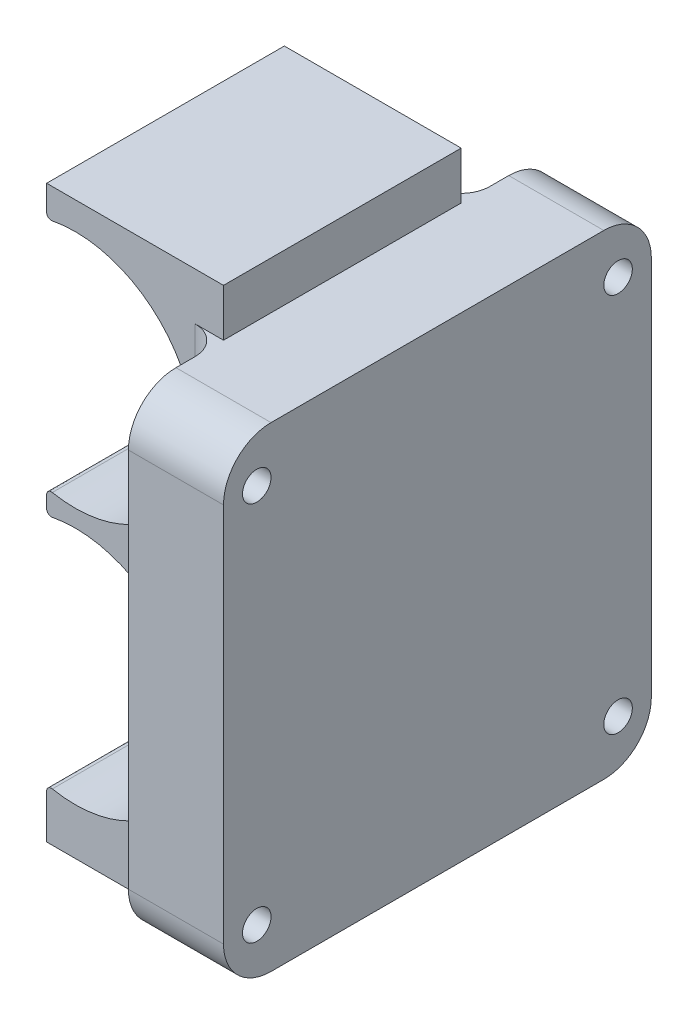
ISO-10303-21;
HEADER;
FILE_DESCRIPTION(('STEP AP214'),'2;1');
FILE_NAME('part.step','',(''),(''),'','','');
FILE_SCHEMA(('AUTOMOTIVE_DESIGN { 1 0 10303 214 1 1 1 1 }'));
ENDSEC;
DATA;
#1=APPLICATION_CONTEXT('core data for automotive mechanical design processes');
#2=APPLICATION_PROTOCOL_DEFINITION('international standard','automotive_design',2000,#1);
#3=PRODUCT_CONTEXT('',#1,'mechanical');
#4=PRODUCT('Part','Part','',(#3));
#5=PRODUCT_RELATED_PRODUCT_CATEGORY('part','',(#4));
#6=PRODUCT_DEFINITION_FORMATION('','',#4);
#7=PRODUCT_DEFINITION_CONTEXT('part definition',#1,'design');
#8=PRODUCT_DEFINITION('design','',#6,#7);
#9=PRODUCT_DEFINITION_SHAPE('','',#8);
#10=(LENGTH_UNIT() NAMED_UNIT(*) SI_UNIT(.MILLI.,.METRE.));
#11=(NAMED_UNIT(*) PLANE_ANGLE_UNIT() SI_UNIT($,.RADIAN.));
#12=(NAMED_UNIT(*) SI_UNIT($,.STERADIAN.) SOLID_ANGLE_UNIT());
#13=UNCERTAINTY_MEASURE_WITH_UNIT(LENGTH_MEASURE(1.E-05),#10,'distance_accuracy_value','');
#14=(GEOMETRIC_REPRESENTATION_CONTEXT(3) GLOBAL_UNCERTAINTY_ASSIGNED_CONTEXT((#13)) GLOBAL_UNIT_ASSIGNED_CONTEXT((#10,
#11,#12)) REPRESENTATION_CONTEXT('',''));
#15=CARTESIAN_POINT('',(0.,0.,0.));
#16=DIRECTION('',(0.,0.,1.));
#17=DIRECTION('',(1.,0.,0.));
#18=AXIS2_PLACEMENT_3D('',#15,#16,#17);
#19=CARTESIAN_POINT('',(0.,0.,25.));
#20=DIRECTION('',(0.,0.,1.));
#21=DIRECTION('',(1.,0.,0.));
#22=AXIS2_PLACEMENT_3D('',#19,#20,#21);
#23=PLANE('',#22);
#24=DIRECTION('',(0.,1.,0.));
#25=VECTOR('',#24,1.);
#26=CARTESIAN_POINT('',(-3.,0.,25.));
#27=LINE('',#26,#25);
#28=CARTESIAN_POINT('',(-3.,42.5,25.));
#29=VERTEX_POINT('',#28);
#30=CARTESIAN_POINT('',(-3.,53.,25.));
#31=VERTEX_POINT('',#30);
#32=EDGE_CURVE('E322',#29,#31,#27,.T.);
#33=ORIENTED_EDGE('',*,*,#32,.T.);
#34=DIRECTION('',(1.,0.,0.));
#35=VECTOR('',#34,1.);
#36=CARTESIAN_POINT('',(10.,53.,25.));
#37=LINE('',#36,#35);
#38=CARTESIAN_POINT('',(0.,53.,25.));
#39=VERTEX_POINT('',#38);
#40=EDGE_CURVE('E325',#31,#39,#37,.T.);
#41=ORIENTED_EDGE('',*,*,#40,.T.);
#42=DIRECTION('',(0.,1.,0.));
#43=VECTOR('',#42,1.);
#44=CARTESIAN_POINT('',(0.,0.,25.));
#45=LINE('',#44,#43);
#46=CARTESIAN_POINT('',(0.,58.,25.));
#47=VERTEX_POINT('',#46);
#48=EDGE_CURVE('E413',#39,#47,#45,.T.);
#49=ORIENTED_EDGE('',*,*,#48,.T.);
#50=DIRECTION('',(-1.,0.,0.));
#51=VECTOR('',#50,1.);
#52=CARTESIAN_POINT('',(0.,58.,25.));
#53=LINE('',#52,#51);
#54=CARTESIAN_POINT('',(-18.6,58.,25.));
#55=VERTEX_POINT('',#54);
#56=EDGE_CURVE('E264',#47,#55,#53,.T.);
#57=ORIENTED_EDGE('',*,*,#56,.T.);
#58=DIRECTION('',(0.,-1.,0.));
#59=VECTOR('',#58,1.);
#60=CARTESIAN_POINT('',(-18.6,0.,25.));
#61=LINE('',#60,#59);
#62=CARTESIAN_POINT('',(-18.6,55.3592379245428,25.));
#63=VERTEX_POINT('',#62);
#64=EDGE_CURVE('E253',#55,#63,#61,.T.);
#65=ORIENTED_EDGE('',*,*,#64,.T.);
#66=CARTESIAN_POINT('',(-18.1,55.3592379245428,25.));
#67=DIRECTION('',(0.,0.,1.));
#68=DIRECTION('',(1.,0.,0.));
#69=AXIS2_PLACEMENT_3D('',#66,#67,#68);
#70=CIRCLE('',#69,0.5);
#71=CARTESIAN_POINT('',(-18.0045801526717,54.8684273167358,25.));
#72=VERTEX_POINT('',#71);
#73=EDGE_CURVE('E289',#63,#72,#70,.T.);
#74=ORIENTED_EDGE('',*,*,#73,.T.);
#75=CARTESIAN_POINT('',(-15.6,42.5,25.));
#76=DIRECTION('',(0.,0.,1.));
#77=DIRECTION('',(1.,0.,0.));
#78=AXIS2_PLACEMENT_3D('',#75,#76,#77);
#79=CIRCLE('',#78,12.6);
#80=EDGE_CURVE('E404',#72,#29,#79,.F.);
#81=ORIENTED_EDGE('',*,*,#80,.T.);
#82=EDGE_LOOP('',(#33,#41,#49,#57,#65,#74,#81));
#83=FACE_BOUND('',#82,.T.);
#84=ADVANCED_FACE('F35',(#83),#23,.T.);
#85=CARTESIAN_POINT('',(-15.6,15.5,25.));
#86=DIRECTION('',(0.,0.,1.));
#87=DIRECTION('',(1.,0.,0.));
#88=AXIS2_PLACEMENT_3D('',#85,#86,#87);
#89=CIRCLE('',#88,12.6);
#90=CARTESIAN_POINT('',(-3.,15.5,25.));
#91=VERTEX_POINT('',#90);
#92=CARTESIAN_POINT('',(-18.0045801526717,27.8684273167358,25.));
#93=VERTEX_POINT('',#92);
#94=EDGE_CURVE('E410',#91,#93,#89,.T.);
#95=ORIENTED_EDGE('',*,*,#94,.F.);
#96=DIRECTION('',(0.,1.,0.));
#97=VECTOR('',#96,1.);
#98=CARTESIAN_POINT('',(-3.,0.,25.));
#99=LINE('',#98,#97);
#100=EDGE_CURVE('E320',#91,#29,#99,.T.);
#101=ORIENTED_EDGE('',*,*,#100,.T.);
#102=CARTESIAN_POINT('',(-18.0045801526717,30.1315726832642,25.));
#103=VERTEX_POINT('',#102);
#104=EDGE_CURVE('E401',#29,#103,#79,.F.);
#105=ORIENTED_EDGE('',*,*,#104,.T.);
#106=CARTESIAN_POINT('',(-18.1,29.6407620754572,25.));
#107=DIRECTION('',(0.,0.,1.));
#108=DIRECTION('',(1.,0.,0.));
#109=AXIS2_PLACEMENT_3D('',#106,#107,#108);
#110=CIRCLE('',#109,0.5);
#111=CARTESIAN_POINT('',(-18.6,29.6407620754572,25.));
#112=VERTEX_POINT('',#111);
#113=EDGE_CURVE('E284',#103,#112,#110,.T.);
#114=ORIENTED_EDGE('',*,*,#113,.T.);
#115=CARTESIAN_POINT('',(-18.6,28.3592379245428,25.));
#116=VERTEX_POINT('',#115);
#117=EDGE_CURVE('E402',#112,#116,#61,.T.);
#118=ORIENTED_EDGE('',*,*,#117,.T.);
#119=CARTESIAN_POINT('',(-18.1,28.3592379245428,25.));
#120=DIRECTION('',(0.,0.,1.));
#121=DIRECTION('',(1.,0.,0.));
#122=AXIS2_PLACEMENT_3D('',#119,#120,#121);
#123=CIRCLE('',#122,0.5);
#124=EDGE_CURVE('E286',#116,#93,#123,.T.);
#125=ORIENTED_EDGE('',*,*,#124,.T.);
#126=EDGE_LOOP('',(#95,#101,#105,#114,#118,#125));
#127=FACE_BOUND('',#126,.T.);
#128=ADVANCED_FACE('F441',(#127),#23,.T.);
#129=CARTESIAN_POINT('',(0.,0.,0.));
#130=DIRECTION('',(0.,0.,1.));
#131=DIRECTION('',(1.,0.,0.));
#132=AXIS2_PLACEMENT_3D('',#129,#130,#131);
#133=PLANE('',#132);
#134=DIRECTION('',(0.,1.,0.));
#135=VECTOR('',#134,1.);
#136=CARTESIAN_POINT('',(0.,0.,0.));
#137=LINE('',#136,#135);
#138=CARTESIAN_POINT('',(0.,53.,0.));
#139=VERTEX_POINT('',#138);
#140=CARTESIAN_POINT('',(0.,58.,0.));
#141=VERTEX_POINT('',#140);
#142=EDGE_CURVE('E251',#139,#141,#137,.T.);
#143=ORIENTED_EDGE('',*,*,#142,.F.);
#144=DIRECTION('',(-1.,0.,0.));
#145=VECTOR('',#144,1.);
#146=CARTESIAN_POINT('',(0.,53.,0.));
#147=LINE('',#146,#145);
#148=CARTESIAN_POINT('',(-3.,53.,0.));
#149=VERTEX_POINT('',#148);
#150=EDGE_CURVE('E313',#139,#149,#147,.T.);
#151=ORIENTED_EDGE('',*,*,#150,.T.);
#152=DIRECTION('',(0.,1.,0.));
#153=VECTOR('',#152,1.);
#154=CARTESIAN_POINT('',(-3.,3.,0.));
#155=LINE('',#154,#153);
#156=CARTESIAN_POINT('',(-3.,42.5,0.));
#157=VERTEX_POINT('',#156);
#158=EDGE_CURVE('E311',#149,#157,#155,.F.);
#159=ORIENTED_EDGE('',*,*,#158,.T.);
#160=CARTESIAN_POINT('',(-15.6,42.5,0.));
#161=DIRECTION('',(0.,0.,1.));
#162=DIRECTION('',(1.,0.,0.));
#163=AXIS2_PLACEMENT_3D('',#160,#161,#162);
#164=CIRCLE('',#163,12.6);
#165=CARTESIAN_POINT('',(-18.0045801526717,54.8684273167358,0.));
#166=VERTEX_POINT('',#165);
#167=EDGE_CURVE('E418',#166,#157,#164,.F.);
#168=ORIENTED_EDGE('',*,*,#167,.F.);
#169=CARTESIAN_POINT('',(-18.1,55.3592379245428,0.));
#170=DIRECTION('',(0.,0.,1.));
#171=DIRECTION('',(1.,0.,0.));
#172=AXIS2_PLACEMENT_3D('',#169,#170,#171);
#173=CIRCLE('',#172,0.5);
#174=CARTESIAN_POINT('',(-18.6,55.3592379245428,0.));
#175=VERTEX_POINT('',#174);
#176=EDGE_CURVE('E275',#166,#175,#173,.F.);
#177=ORIENTED_EDGE('',*,*,#176,.T.);
#178=DIRECTION('',(0.,-1.,0.));
#179=VECTOR('',#178,1.);
#180=CARTESIAN_POINT('',(-18.6,0.,0.));
#181=LINE('',#180,#179);
#182=CARTESIAN_POINT('',(-18.6,58.,0.));
#183=VERTEX_POINT('',#182);
#184=EDGE_CURVE('E398',#183,#175,#181,.T.);
#185=ORIENTED_EDGE('',*,*,#184,.F.);
#186=DIRECTION('',(-1.,0.,0.));
#187=VECTOR('',#186,1.);
#188=CARTESIAN_POINT('',(0.,58.,0.));
#189=LINE('',#188,#187);
#190=EDGE_CURVE('E250',#141,#183,#189,.T.);
#191=ORIENTED_EDGE('',*,*,#190,.F.);
#192=EDGE_LOOP('',(#143,#151,#159,#168,#177,#185,#191));
#193=FACE_BOUND('',#192,.T.);
#194=ADVANCED_FACE('F472',(#193),#133,.F.);
#195=CARTESIAN_POINT('',(-18.0045801526717,30.1315726832642,0.));
#196=VERTEX_POINT('',#195);
#197=EDGE_CURVE('E416',#157,#196,#164,.F.);
#198=ORIENTED_EDGE('',*,*,#197,.F.);
#199=DIRECTION('',(0.,1.,0.));
#200=VECTOR('',#199,1.);
#201=CARTESIAN_POINT('',(-3.,3.,0.));
#202=LINE('',#201,#200);
#203=CARTESIAN_POINT('',(-3.,15.5,0.));
#204=VERTEX_POINT('',#203);
#205=EDGE_CURVE('E309',#157,#204,#202,.F.);
#206=ORIENTED_EDGE('',*,*,#205,.T.);
#207=CARTESIAN_POINT('',(-15.6,15.5,0.));
#208=DIRECTION('',(0.,0.,1.));
#209=DIRECTION('',(1.,0.,0.));
#210=AXIS2_PLACEMENT_3D('',#207,#208,#209);
#211=CIRCLE('',#210,12.6);
#212=CARTESIAN_POINT('',(-18.0045801526717,27.8684273167358,0.));
#213=VERTEX_POINT('',#212);
#214=EDGE_CURVE('E424',#204,#213,#211,.T.);
#215=ORIENTED_EDGE('',*,*,#214,.T.);
#216=CARTESIAN_POINT('',(-18.1,28.3592379245428,0.));
#217=DIRECTION('',(0.,0.,1.));
#218=DIRECTION('',(1.,0.,0.));
#219=AXIS2_PLACEMENT_3D('',#216,#217,#218);
#220=CIRCLE('',#219,0.5);
#221=CARTESIAN_POINT('',(-18.6,28.3592379245428,0.));
#222=VERTEX_POINT('',#221);
#223=EDGE_CURVE('E273',#213,#222,#220,.F.);
#224=ORIENTED_EDGE('',*,*,#223,.T.);
#225=CARTESIAN_POINT('',(-18.6,29.6407620754572,0.));
#226=VERTEX_POINT('',#225);
#227=EDGE_CURVE('E417',#226,#222,#181,.T.);
#228=ORIENTED_EDGE('',*,*,#227,.F.);
#229=CARTESIAN_POINT('',(-18.1,29.6407620754572,0.));
#230=DIRECTION('',(0.,0.,1.));
#231=DIRECTION('',(1.,0.,0.));
#232=AXIS2_PLACEMENT_3D('',#229,#230,#231);
#233=CIRCLE('',#232,0.5);
#234=EDGE_CURVE('E270',#226,#196,#233,.F.);
#235=ORIENTED_EDGE('',*,*,#234,.T.);
#236=EDGE_LOOP('',(#198,#206,#215,#224,#228,#235));
#237=FACE_BOUND('',#236,.T.);
#238=ADVANCED_FACE('F433',(#237),#133,.F.);
#239=CARTESIAN_POINT('',(0.,0.,25.));
#240=DIRECTION('',(-1.,0.,0.));
#241=DIRECTION('',(0.,0.,1.));
#242=AXIS2_PLACEMENT_3D('',#239,#240,#241);
#243=PLANE('',#242);
#244=DIRECTION('',(0.,0.,-1.));
#245=VECTOR('',#244,1.);
#246=CARTESIAN_POINT('',(0.,3.,0.));
#247=LINE('',#246,#245);
#248=CARTESIAN_POINT('',(0.,3.,25.));
#249=VERTEX_POINT('',#248);
#250=CARTESIAN_POINT('',(0.,3.,0.));
#251=VERTEX_POINT('',#250);
#252=EDGE_CURVE('E235',#249,#251,#247,.T.);
#253=ORIENTED_EDGE('',*,*,#252,.F.);
#254=CARTESIAN_POINT('',(0.,-2.,25.));
#255=VERTEX_POINT('',#254);
#256=EDGE_CURVE('E411',#255,#249,#45,.T.);
#257=ORIENTED_EDGE('',*,*,#256,.F.);
#258=DIRECTION('',(0.,0.,1.));
#259=VECTOR('',#258,1.);
#260=CARTESIAN_POINT('',(0.,-2.,0.));
#261=LINE('',#260,#259);
#262=CARTESIAN_POINT('',(0.,-2.,0.));
#263=VERTEX_POINT('',#262);
#264=EDGE_CURVE('E249',#263,#255,#261,.T.);
#265=ORIENTED_EDGE('',*,*,#264,.F.);
#266=EDGE_CURVE('E226',#263,#251,#137,.T.);
#267=ORIENTED_EDGE('',*,*,#266,.T.);
#268=EDGE_LOOP('',(#253,#257,#265,#267));
#269=FACE_BOUND('',#268,.T.);
#270=ADVANCED_FACE('F247',(#269),#243,.F.);
#271=CARTESIAN_POINT('',(-18.6,0.,25.));
#272=DIRECTION('',(1.,0.,0.));
#273=DIRECTION('',(0.,0.,-1.));
#274=AXIS2_PLACEMENT_3D('',#271,#272,#273);
#275=PLANE('',#274);
#276=ORIENTED_EDGE('',*,*,#184,.T.);
#277=DIRECTION('',(0.,0.,-1.));
#278=VECTOR('',#277,1.);
#279=CARTESIAN_POINT('',(-18.6,55.3592379245428,25.));
#280=LINE('',#279,#278);
#281=EDGE_CURVE('E299',#175,#63,#280,.F.);
#282=ORIENTED_EDGE('',*,*,#281,.T.);
#283=ORIENTED_EDGE('',*,*,#64,.F.);
#284=DIRECTION('',(0.,0.,-1.));
#285=VECTOR('',#284,1.);
#286=CARTESIAN_POINT('',(-18.6,58.,25.));
#287=LINE('',#286,#285);
#288=EDGE_CURVE('E260',#55,#183,#287,.T.);
#289=ORIENTED_EDGE('',*,*,#288,.T.);
#290=EDGE_LOOP('',(#276,#282,#283,#289));
#291=FACE_BOUND('',#290,.T.);
#292=ADVANCED_FACE('F465',(#291),#275,.F.);
#293=CARTESIAN_POINT('',(-15.6,42.5,25.));
#294=DIRECTION('',(0.,0.,-1.));
#295=DIRECTION('',(-1.,0.,0.));
#296=AXIS2_PLACEMENT_3D('',#293,#294,#295);
#297=CYLINDRICAL_SURFACE('',#296,12.6);
#298=ORIENTED_EDGE('',*,*,#80,.F.);
#299=DIRECTION('',(0.,0.,-1.));
#300=VECTOR('',#299,1.);
#301=CARTESIAN_POINT('',(-18.0045801526717,54.8684273167358,25.));
#302=LINE('',#301,#300);
#303=EDGE_CURVE('E296',#72,#166,#302,.T.);
#304=ORIENTED_EDGE('',*,*,#303,.T.);
#305=ORIENTED_EDGE('',*,*,#167,.T.);
#306=ORIENTED_EDGE('',*,*,#197,.T.);
#307=DIRECTION('',(0.,0.,-1.));
#308=VECTOR('',#307,1.);
#309=CARTESIAN_POINT('',(-18.0045801526717,30.1315726832642,25.));
#310=LINE('',#309,#308);
#311=EDGE_CURVE('E293',#196,#103,#310,.F.);
#312=ORIENTED_EDGE('',*,*,#311,.T.);
#313=ORIENTED_EDGE('',*,*,#104,.F.);
#314=EDGE_LOOP('',(#298,#304,#305,#306,#312,#313));
#315=FACE_BOUND('',#314,.T.);
#316=ADVANCED_FACE('F427',(#315),#297,.F.);
#317=ORIENTED_EDGE('',*,*,#227,.T.);
#318=DIRECTION('',(0.,0.,1.));
#319=VECTOR('',#318,1.);
#320=CARTESIAN_POINT('',(-18.6,28.3592379245428,25.));
#321=LINE('',#320,#319);
#322=EDGE_CURVE('E304',#222,#116,#321,.T.);
#323=ORIENTED_EDGE('',*,*,#322,.T.);
#324=ORIENTED_EDGE('',*,*,#117,.F.);
#325=DIRECTION('',(0.,0.,-1.));
#326=VECTOR('',#325,1.);
#327=CARTESIAN_POINT('',(-18.6,29.6407620754572,25.));
#328=LINE('',#327,#326);
#329=EDGE_CURVE('E301',#112,#226,#328,.T.);
#330=ORIENTED_EDGE('',*,*,#329,.T.);
#331=EDGE_LOOP('',(#317,#323,#324,#330));
#332=FACE_BOUND('',#331,.T.);
#333=ADVANCED_FACE('F444',(#332),#275,.F.);
#334=CARTESIAN_POINT('',(-15.6,15.5,25.));
#335=DIRECTION('',(0.,0.,-1.));
#336=DIRECTION('',(-1.,0.,0.));
#337=AXIS2_PLACEMENT_3D('',#334,#335,#336);
#338=CYLINDRICAL_SURFACE('',#337,12.6);
#339=CARTESIAN_POINT('',(-18.0045801526717,3.13157268326417,0.));
#340=VERTEX_POINT('',#339);
#341=EDGE_CURVE('E257',#340,#204,#211,.T.);
#342=ORIENTED_EDGE('',*,*,#341,.F.);
#343=DIRECTION('',(0.,0.,-1.));
#344=VECTOR('',#343,1.);
#345=CARTESIAN_POINT('',(-18.0045801526717,3.13157268326417,25.));
#346=LINE('',#345,#344);
#347=CARTESIAN_POINT('',(-18.0045801526717,3.13157268326417,25.));
#348=VERTEX_POINT('',#347);
#349=EDGE_CURVE('E282',#340,#348,#346,.F.);
#350=ORIENTED_EDGE('',*,*,#349,.T.);
#351=EDGE_CURVE('E407',#348,#91,#89,.T.);
#352=ORIENTED_EDGE('',*,*,#351,.T.);
#353=ORIENTED_EDGE('',*,*,#94,.T.);
#354=DIRECTION('',(0.,0.,-1.));
#355=VECTOR('',#354,1.);
#356=CARTESIAN_POINT('',(-18.0045801526717,27.8684273167358,25.));
#357=LINE('',#356,#355);
#358=EDGE_CURVE('E279',#93,#213,#357,.T.);
#359=ORIENTED_EDGE('',*,*,#358,.T.);
#360=ORIENTED_EDGE('',*,*,#214,.F.);
#361=EDGE_LOOP('',(#342,#350,#352,#353,#359,#360));
#362=FACE_BOUND('',#361,.T.);
#363=ADVANCED_FACE('F481',(#362),#338,.F.);
#364=CARTESIAN_POINT('',(-18.6,2.64076207545719,25.));
#365=VERTEX_POINT('',#364);
#366=CARTESIAN_POINT('',(-18.6,-2.,25.));
#367=VERTEX_POINT('',#366);
#368=EDGE_CURVE('E403',#365,#367,#61,.T.);
#369=ORIENTED_EDGE('',*,*,#368,.F.);
#370=DIRECTION('',(0.,0.,1.));
#371=VECTOR('',#370,1.);
#372=CARTESIAN_POINT('',(-18.6,2.64076207545719,0.));
#373=LINE('',#372,#371);
#374=CARTESIAN_POINT('',(-18.6,2.64076207545719,0.));
#375=VERTEX_POINT('',#374);
#376=EDGE_CURVE('E267',#365,#375,#373,.F.);
#377=ORIENTED_EDGE('',*,*,#376,.T.);
#378=CARTESIAN_POINT('',(-18.6,-2.,0.));
#379=VERTEX_POINT('',#378);
#380=EDGE_CURVE('E255',#375,#379,#181,.T.);
#381=ORIENTED_EDGE('',*,*,#380,.T.);
#382=DIRECTION('',(0.,0.,-1.));
#383=VECTOR('',#382,1.);
#384=CARTESIAN_POINT('',(-18.6,-2.,25.));
#385=LINE('',#384,#383);
#386=EDGE_CURVE('E388',#367,#379,#385,.T.);
#387=ORIENTED_EDGE('',*,*,#386,.F.);
#388=EDGE_LOOP('',(#369,#377,#381,#387));
#389=FACE_BOUND('',#388,.T.);
#390=ADVANCED_FACE('F487',(#389),#275,.F.);
#391=ORIENTED_EDGE('',*,*,#48,.F.);
#392=DIRECTION('',(0.,0.,-1.));
#393=VECTOR('',#392,1.);
#394=CARTESIAN_POINT('',(0.,53.,0.));
#395=LINE('',#394,#393);
#396=EDGE_CURVE('E242',#39,#139,#395,.T.);
#397=ORIENTED_EDGE('',*,*,#396,.T.);
#398=ORIENTED_EDGE('',*,*,#142,.T.);
#399=DIRECTION('',(0.,0.,-1.));
#400=VECTOR('',#399,1.);
#401=CARTESIAN_POINT('',(0.,58.,25.));
#402=LINE('',#401,#400);
#403=EDGE_CURVE('E263',#47,#141,#402,.T.);
#404=ORIENTED_EDGE('',*,*,#403,.F.);
#405=EDGE_LOOP('',(#391,#397,#398,#404));
#406=FACE_BOUND('',#405,.T.);
#407=ADVANCED_FACE('F457',(#406),#243,.F.);
#408=CARTESIAN_POINT('',(0.,58.,25.));
#409=DIRECTION('',(0.,-1.,0.));
#410=DIRECTION('',(0.,0.,-1.));
#411=AXIS2_PLACEMENT_3D('',#408,#409,#410);
#412=PLANE('',#411);
#413=ORIENTED_EDGE('',*,*,#190,.T.);
#414=ORIENTED_EDGE('',*,*,#288,.F.);
#415=ORIENTED_EDGE('',*,*,#56,.F.);
#416=ORIENTED_EDGE('',*,*,#403,.T.);
#417=EDGE_LOOP('',(#413,#414,#415,#416));
#418=FACE_BOUND('',#417,.T.);
#419=ADVANCED_FACE('F461',(#418),#412,.F.);
#420=DIRECTION('',(-1.,0.,0.));
#421=VECTOR('',#420,1.);
#422=CARTESIAN_POINT('',(0.,3.,25.));
#423=LINE('',#422,#421);
#424=CARTESIAN_POINT('',(-3.,3.,25.));
#425=VERTEX_POINT('',#424);
#426=EDGE_CURVE('E239',#249,#425,#423,.T.);
#427=ORIENTED_EDGE('',*,*,#426,.T.);
#428=DIRECTION('',(0.,1.,0.));
#429=VECTOR('',#428,1.);
#430=CARTESIAN_POINT('',(-3.,0.,25.));
#431=LINE('',#430,#429);
#432=EDGE_CURVE('E317',#425,#91,#431,.T.);
#433=ORIENTED_EDGE('',*,*,#432,.T.);
#434=ORIENTED_EDGE('',*,*,#351,.F.);
#435=CARTESIAN_POINT('',(-18.1,2.64076207545719,25.));
#436=DIRECTION('',(0.,0.,1.));
#437=DIRECTION('',(1.,0.,0.));
#438=AXIS2_PLACEMENT_3D('',#435,#436,#437);
#439=CIRCLE('',#438,0.5);
#440=EDGE_CURVE('E291',#348,#365,#439,.T.);
#441=ORIENTED_EDGE('',*,*,#440,.T.);
#442=ORIENTED_EDGE('',*,*,#368,.T.);
#443=DIRECTION('',(-1.,0.,0.));
#444=VECTOR('',#443,1.);
#445=CARTESIAN_POINT('',(0.,-2.,25.));
#446=LINE('',#445,#444);
#447=EDGE_CURVE('E395',#255,#367,#446,.T.);
#448=ORIENTED_EDGE('',*,*,#447,.F.);
#449=ORIENTED_EDGE('',*,*,#256,.T.);
#450=EDGE_LOOP('',(#427,#433,#434,#441,#442,#448,#449));
#451=FACE_BOUND('',#450,.T.);
#452=ADVANCED_FACE('F491',(#451),#23,.T.);
#453=ORIENTED_EDGE('',*,*,#341,.T.);
#454=DIRECTION('',(0.,1.,0.));
#455=VECTOR('',#454,1.);
#456=CARTESIAN_POINT('',(-3.,3.,0.));
#457=LINE('',#456,#455);
#458=CARTESIAN_POINT('',(-3.,3.,0.));
#459=VERTEX_POINT('',#458);
#460=EDGE_CURVE('E229',#204,#459,#457,.F.);
#461=ORIENTED_EDGE('',*,*,#460,.T.);
#462=DIRECTION('',(1.,0.,0.));
#463=VECTOR('',#462,1.);
#464=CARTESIAN_POINT('',(10.,3.,0.));
#465=LINE('',#464,#463);
#466=EDGE_CURVE('E220',#459,#251,#465,.T.);
#467=ORIENTED_EDGE('',*,*,#466,.T.);
#468=ORIENTED_EDGE('',*,*,#266,.F.);
#469=DIRECTION('',(1.,0.,0.));
#470=VECTOR('',#469,1.);
#471=CARTESIAN_POINT('',(-18.6,-2.,0.));
#472=LINE('',#471,#470);
#473=EDGE_CURVE('E391',#379,#263,#472,.T.);
#474=ORIENTED_EDGE('',*,*,#473,.F.);
#475=ORIENTED_EDGE('',*,*,#380,.F.);
#476=CARTESIAN_POINT('',(-18.1,2.64076207545719,0.));
#477=DIRECTION('',(0.,0.,1.));
#478=DIRECTION('',(1.,0.,0.));
#479=AXIS2_PLACEMENT_3D('',#476,#477,#478);
#480=CIRCLE('',#479,0.5);
#481=EDGE_CURVE('E277',#375,#340,#480,.F.);
#482=ORIENTED_EDGE('',*,*,#481,.T.);
#483=EDGE_LOOP('',(#453,#461,#467,#468,#474,#475,#482));
#484=FACE_BOUND('',#483,.T.);
#485=ADVANCED_FACE('F223',(#484),#133,.F.);
#486=CARTESIAN_POINT('',(0.,-2.,0.));
#487=DIRECTION('',(0.,-1.,0.));
#488=DIRECTION('',(1.,0.,0.));
#489=AXIS2_PLACEMENT_3D('',#486,#487,#488);
#490=PLANE('',#489);
#491=ORIENTED_EDGE('',*,*,#386,.T.);
#492=ORIENTED_EDGE('',*,*,#473,.T.);
#493=ORIENTED_EDGE('',*,*,#264,.T.);
#494=ORIENTED_EDGE('',*,*,#447,.T.);
#495=EDGE_LOOP('',(#491,#492,#493,#494));
#496=FACE_BOUND('',#495,.T.);
#497=ADVANCED_FACE('F490',(#496),#490,.T.);
#498=CARTESIAN_POINT('',(-18.1,2.64076207545719,25.));
#499=DIRECTION('',(0.,0.,-1.));
#500=DIRECTION('',(-1.,0.,0.));
#501=AXIS2_PLACEMENT_3D('',#498,#499,#500);
#502=CYLINDRICAL_SURFACE('',#501,0.5);
#503=ORIENTED_EDGE('',*,*,#440,.F.);
#504=ORIENTED_EDGE('',*,*,#349,.F.);
#505=ORIENTED_EDGE('',*,*,#481,.F.);
#506=ORIENTED_EDGE('',*,*,#376,.F.);
#507=EDGE_LOOP('',(#503,#504,#505,#506));
#508=FACE_BOUND('',#507,.T.);
#509=ADVANCED_FACE('F571',(#508),#502,.T.);
#510=CARTESIAN_POINT('',(-18.1,55.3592379245428,25.));
#511=DIRECTION('',(0.,0.,-1.));
#512=DIRECTION('',(-1.,0.,0.));
#513=AXIS2_PLACEMENT_3D('',#510,#511,#512);
#514=CYLINDRICAL_SURFACE('',#513,0.5);
#515=ORIENTED_EDGE('',*,*,#73,.F.);
#516=ORIENTED_EDGE('',*,*,#281,.F.);
#517=ORIENTED_EDGE('',*,*,#176,.F.);
#518=ORIENTED_EDGE('',*,*,#303,.F.);
#519=EDGE_LOOP('',(#515,#516,#517,#518));
#520=FACE_BOUND('',#519,.T.);
#521=ADVANCED_FACE('F470',(#520),#514,.T.);
#522=CARTESIAN_POINT('',(-18.1,28.3592379245428,25.));
#523=DIRECTION('',(0.,0.,-1.));
#524=DIRECTION('',(-1.,0.,0.));
#525=AXIS2_PLACEMENT_3D('',#522,#523,#524);
#526=CYLINDRICAL_SURFACE('',#525,0.5);
#527=ORIENTED_EDGE('',*,*,#124,.F.);
#528=ORIENTED_EDGE('',*,*,#322,.F.);
#529=ORIENTED_EDGE('',*,*,#223,.F.);
#530=ORIENTED_EDGE('',*,*,#358,.F.);
#531=EDGE_LOOP('',(#527,#528,#529,#530));
#532=FACE_BOUND('',#531,.T.);
#533=ADVANCED_FACE('F577',(#532),#526,.T.);
#534=CARTESIAN_POINT('',(-18.1,29.6407620754572,25.));
#535=DIRECTION('',(0.,0.,-1.));
#536=DIRECTION('',(-1.,0.,0.));
#537=AXIS2_PLACEMENT_3D('',#534,#535,#536);
#538=CYLINDRICAL_SURFACE('',#537,0.5);
#539=ORIENTED_EDGE('',*,*,#113,.F.);
#540=ORIENTED_EDGE('',*,*,#311,.F.);
#541=ORIENTED_EDGE('',*,*,#234,.F.);
#542=ORIENTED_EDGE('',*,*,#329,.F.);
#543=EDGE_LOOP('',(#539,#540,#541,#542));
#544=FACE_BOUND('',#543,.T.);
#545=ADVANCED_FACE('F436',(#544),#538,.T.);
#546=CARTESIAN_POINT('',(0.,0.,0.));
#547=DIRECTION('',(1.,0.,0.));
#548=DIRECTION('',(0.,0.,-1.));
#549=AXIS2_PLACEMENT_3D('',#546,#547,#548);
#550=PLANE('',#549);
#551=CARTESIAN_POINT('',(0.,8.,-6.5));
#552=DIRECTION('',(-1.,0.,0.));
#553=DIRECTION('',(0.,0.,1.));
#554=AXIS2_PLACEMENT_3D('',#551,#552,#553);
#555=CIRCLE('',#554,1.5);
#556=CARTESIAN_POINT('',(0.,8.,-5.));
#557=VERTEX_POINT('',#556);
#558=EDGE_CURVE('E886',#557,#557,#555,.T.);
#559=ORIENTED_EDGE('',*,*,#558,.F.);
#560=EDGE_LOOP('',(#559));
#561=FACE_BOUND('',#560,.T.);
#562=CARTESIAN_POINT('',(0.,48.,-6.5));
#563=DIRECTION('',(-1.,0.,0.));
#564=DIRECTION('',(0.,0.,1.));
#565=AXIS2_PLACEMENT_3D('',#562,#563,#564);
#566=CIRCLE('',#565,1.5);
#567=CARTESIAN_POINT('',(0.,48.,-5.));
#568=VERTEX_POINT('',#567);
#569=EDGE_CURVE('E520',#568,#568,#566,.T.);
#570=ORIENTED_EDGE('',*,*,#569,.F.);
#571=EDGE_LOOP('',(#570));
#572=FACE_BOUND('',#571,.T.);
#573=CARTESIAN_POINT('',(0.,53.,-3.));
#574=VERTEX_POINT('',#573);
#575=CARTESIAN_POINT('',(0.,53.,-5.00000000000001));
#576=VERTEX_POINT('',#575);
#577=EDGE_CURVE('E378',#574,#576,#395,.T.);
#578=ORIENTED_EDGE('',*,*,#577,.T.);
#579=CARTESIAN_POINT('',(0.,48.,-5.));
#580=DIRECTION('',(1.,0.,0.));
#581=DIRECTION('',(0.,0.,-1.));
#582=AXIS2_PLACEMENT_3D('',#579,#580,#581);
#583=CIRCLE('',#582,5.);
#584=CARTESIAN_POINT('',(0.,48.,-10.));
#585=VERTEX_POINT('',#584);
#586=EDGE_CURVE('E58',#576,#585,#583,.F.);
#587=ORIENTED_EDGE('',*,*,#586,.T.);
#588=DIRECTION('',(0.,-1.,0.));
#589=VECTOR('',#588,1.);
#590=CARTESIAN_POINT('',(0.,0.,-9.99999999999999));
#591=LINE('',#590,#589);
#592=CARTESIAN_POINT('',(0.,8.,-10.));
#593=VERTEX_POINT('',#592);
#594=EDGE_CURVE('E370',#585,#593,#591,.T.);
#595=ORIENTED_EDGE('',*,*,#594,.T.);
#596=CARTESIAN_POINT('',(0.,8.,-5.));
#597=DIRECTION('',(1.,0.,0.));
#598=DIRECTION('',(0.,0.,-1.));
#599=AXIS2_PLACEMENT_3D('',#596,#597,#598);
#600=CIRCLE('',#599,5.);
#601=CARTESIAN_POINT('',(0.,3.,-4.99999999999999));
#602=VERTEX_POINT('',#601);
#603=EDGE_CURVE('E50',#593,#602,#600,.F.);
#604=ORIENTED_EDGE('',*,*,#603,.T.);
#605=CARTESIAN_POINT('',(0.,3.,-3.));
#606=VERTEX_POINT('',#605);
#607=EDGE_CURVE('E245',#606,#602,#247,.T.);
#608=ORIENTED_EDGE('',*,*,#607,.F.);
#609=DIRECTION('',(0.,1.,0.));
#610=VECTOR('',#609,1.);
#611=CARTESIAN_POINT('',(0.,53.,-3.));
#612=LINE('',#611,#610);
#613=EDGE_CURVE('E232',#606,#574,#612,.T.);
#614=ORIENTED_EDGE('',*,*,#613,.T.);
#615=EDGE_LOOP('',(#578,#587,#595,#604,#608,#614));
#616=FACE_BOUND('',#615,.T.);
#617=ADVANCED_FACE('F375',(#561,#572,#616),#550,.F.);
#618=CARTESIAN_POINT('',(10.,3.,0.));
#619=DIRECTION('',(0.,1.,0.));
#620=DIRECTION('',(0.,0.,1.));
#621=AXIS2_PLACEMENT_3D('',#618,#619,#620);
#622=PLANE('',#621);
#623=DIRECTION('',(0.,0.,-1.));
#624=VECTOR('',#623,1.);
#625=CARTESIAN_POINT('',(10.,3.,0.));
#626=LINE('',#625,#624);
#627=CARTESIAN_POINT('',(10.,3.,30.));
#628=VERTEX_POINT('',#627);
#629=CARTESIAN_POINT('',(10.,3.,-4.99999999999999));
#630=VERTEX_POINT('',#629);
#631=EDGE_CURVE('E387',#628,#630,#626,.T.);
#632=ORIENTED_EDGE('',*,*,#631,.F.);
#633=DIRECTION('',(-1.,0.,0.));
#634=VECTOR('',#633,1.);
#635=CARTESIAN_POINT('',(10.,3.,30.));
#636=LINE('',#635,#634);
#637=CARTESIAN_POINT('',(0.,3.,30.));
#638=VERTEX_POINT('',#637);
#639=EDGE_CURVE('E341',#628,#638,#636,.T.);
#640=ORIENTED_EDGE('',*,*,#639,.T.);
#641=CARTESIAN_POINT('',(0.,3.,28.));
#642=VERTEX_POINT('',#641);
#643=EDGE_CURVE('E244',#638,#642,#247,.T.);
#644=ORIENTED_EDGE('',*,*,#643,.T.);
#645=CARTESIAN_POINT('',(-3.,3.,28.));
#646=DIRECTION('',(0.,1.,0.));
#647=DIRECTION('',(0.,0.,1.));
#648=AXIS2_PLACEMENT_3D('',#645,#646,#647);
#649=CIRCLE('',#648,3.);
#650=EDGE_CURVE('E337',#642,#425,#649,.T.);
#651=ORIENTED_EDGE('',*,*,#650,.T.);
#652=ORIENTED_EDGE('',*,*,#426,.F.);
#653=ORIENTED_EDGE('',*,*,#252,.T.);
#654=ORIENTED_EDGE('',*,*,#466,.F.);
#655=CARTESIAN_POINT('',(-3.,3.,-3.));
#656=DIRECTION('',(0.,1.,0.));
#657=DIRECTION('',(0.,0.,1.));
#658=AXIS2_PLACEMENT_3D('',#655,#656,#657);
#659=CIRCLE('',#658,3.);
#660=EDGE_CURVE('E332',#459,#606,#659,.T.);
#661=ORIENTED_EDGE('',*,*,#660,.T.);
#662=ORIENTED_EDGE('',*,*,#607,.T.);
#663=DIRECTION('',(-1.,0.,0.));
#664=VECTOR('',#663,1.);
#665=CARTESIAN_POINT('',(10.,3.,-4.99999999999999));
#666=LINE('',#665,#664);
#667=EDGE_CURVE('E339',#602,#630,#666,.F.);
#668=ORIENTED_EDGE('',*,*,#667,.T.);
#669=EDGE_LOOP('',(#632,#640,#644,#651,#652,#653,#654,#661,#662,#668));
#670=FACE_BOUND('',#669,.T.);
#671=ADVANCED_FACE('F237',(#670),#622,.F.);
#672=CARTESIAN_POINT('',(10.,0.,-9.99999999999999));
#673=DIRECTION('',(0.,0.,-1.));
#674=DIRECTION('',(0.,1.,0.));
#675=AXIS2_PLACEMENT_3D('',#672,#673,#674);
#676=PLANE('',#675);
#677=ORIENTED_EDGE('',*,*,#594,.F.);
#678=DIRECTION('',(-1.,0.,0.));
#679=VECTOR('',#678,1.);
#680=CARTESIAN_POINT('',(10.,48.,-10.));
#681=LINE('',#680,#679);
#682=CARTESIAN_POINT('',(10.,48.,-10.));
#683=VERTEX_POINT('',#682);
#684=EDGE_CURVE('E11',#585,#683,#681,.F.);
#685=ORIENTED_EDGE('',*,*,#684,.T.);
#686=DIRECTION('',(0.,-1.,0.));
#687=VECTOR('',#686,1.);
#688=CARTESIAN_POINT('',(10.,0.,-9.99999999999999));
#689=LINE('',#688,#687);
#690=CARTESIAN_POINT('',(10.,8.,-10.));
#691=VERTEX_POINT('',#690);
#692=EDGE_CURVE('E373',#683,#691,#689,.T.);
#693=ORIENTED_EDGE('',*,*,#692,.T.);
#694=DIRECTION('',(-1.,0.,0.));
#695=VECTOR('',#694,1.);
#696=CARTESIAN_POINT('',(0.,8.,-9.99999999999999));
#697=LINE('',#696,#695);
#698=EDGE_CURVE('E43',#691,#593,#697,.T.);
#699=ORIENTED_EDGE('',*,*,#698,.T.);
#700=EDGE_LOOP('',(#677,#685,#693,#699));
#701=FACE_BOUND('',#700,.T.);
#702=ADVANCED_FACE('F369',(#701),#676,.T.);
#703=CARTESIAN_POINT('',(10.,53.,0.));
#704=DIRECTION('',(0.,1.,0.));
#705=DIRECTION('',(0.,0.,1.));
#706=AXIS2_PLACEMENT_3D('',#703,#704,#705);
#707=PLANE('',#706);
#708=DIRECTION('',(0.,0.,-1.));
#709=VECTOR('',#708,1.);
#710=CARTESIAN_POINT('',(10.,53.,0.));
#711=LINE('',#710,#709);
#712=CARTESIAN_POINT('',(10.,53.,30.));
#713=VERTEX_POINT('',#712);
#714=CARTESIAN_POINT('',(10.,53.,-5.00000000000001));
#715=VERTEX_POINT('',#714);
#716=EDGE_CURVE('E517',#713,#715,#711,.T.);
#717=ORIENTED_EDGE('',*,*,#716,.T.);
#718=DIRECTION('',(-1.,0.,0.));
#719=VECTOR('',#718,1.);
#720=CARTESIAN_POINT('',(10.,53.,-5.00000000000001));
#721=LINE('',#720,#719);
#722=EDGE_CURVE('E363',#715,#576,#721,.T.);
#723=ORIENTED_EDGE('',*,*,#722,.T.);
#724=ORIENTED_EDGE('',*,*,#577,.F.);
#725=CARTESIAN_POINT('',(-3.,53.,-3.));
#726=DIRECTION('',(0.,1.,0.));
#727=DIRECTION('',(0.,0.,1.));
#728=AXIS2_PLACEMENT_3D('',#725,#726,#727);
#729=CIRCLE('',#728,3.);
#730=EDGE_CURVE('E330',#574,#149,#729,.F.);
#731=ORIENTED_EDGE('',*,*,#730,.T.);
#732=ORIENTED_EDGE('',*,*,#150,.F.);
#733=ORIENTED_EDGE('',*,*,#396,.F.);
#734=ORIENTED_EDGE('',*,*,#40,.F.);
#735=CARTESIAN_POINT('',(-3.,53.,28.));
#736=DIRECTION('',(0.,1.,0.));
#737=DIRECTION('',(0.,0.,1.));
#738=AXIS2_PLACEMENT_3D('',#735,#736,#737);
#739=CIRCLE('',#738,3.);
#740=CARTESIAN_POINT('',(0.,53.,28.));
#741=VERTEX_POINT('',#740);
#742=EDGE_CURVE('E334',#31,#741,#739,.F.);
#743=ORIENTED_EDGE('',*,*,#742,.T.);
#744=CARTESIAN_POINT('',(0.,53.,30.));
#745=VERTEX_POINT('',#744);
#746=EDGE_CURVE('E380',#745,#741,#395,.T.);
#747=ORIENTED_EDGE('',*,*,#746,.F.);
#748=DIRECTION('',(-1.,0.,0.));
#749=VECTOR('',#748,1.);
#750=CARTESIAN_POINT('',(10.,53.,30.));
#751=LINE('',#750,#749);
#752=EDGE_CURVE('E361',#745,#713,#751,.F.);
#753=ORIENTED_EDGE('',*,*,#752,.T.);
#754=EDGE_LOOP('',(#717,#723,#724,#731,#732,#733,#734,#743,#747,#753));
#755=FACE_BOUND('',#754,.T.);
#756=ADVANCED_FACE('F503',(#755),#707,.T.);
#757=CARTESIAN_POINT('',(10.,0.,35.));
#758=DIRECTION('',(0.,0.,-1.));
#759=DIRECTION('',(0.,1.,0.));
#760=AXIS2_PLACEMENT_3D('',#757,#758,#759);
#761=PLANE('',#760);
#762=DIRECTION('',(0.,-1.,0.));
#763=VECTOR('',#762,1.);
#764=CARTESIAN_POINT('',(0.,0.,35.));
#765=LINE('',#764,#763);
#766=CARTESIAN_POINT('',(0.,48.,35.));
#767=VERTEX_POINT('',#766);
#768=CARTESIAN_POINT('',(0.,8.,35.));
#769=VERTEX_POINT('',#768);
#770=EDGE_CURVE('E384',#767,#769,#765,.T.);
#771=ORIENTED_EDGE('',*,*,#770,.T.);
#772=DIRECTION('',(-1.,0.,0.));
#773=VECTOR('',#772,1.);
#774=CARTESIAN_POINT('',(10.,8.,35.));
#775=LINE('',#774,#773);
#776=CARTESIAN_POINT('',(10.,8.,35.));
#777=VERTEX_POINT('',#776);
#778=EDGE_CURVE('E351',#769,#777,#775,.F.);
#779=ORIENTED_EDGE('',*,*,#778,.T.);
#780=DIRECTION('',(0.,-1.,0.));
#781=VECTOR('',#780,1.);
#782=CARTESIAN_POINT('',(10.,0.,35.));
#783=LINE('',#782,#781);
#784=CARTESIAN_POINT('',(10.,48.,35.));
#785=VERTEX_POINT('',#784);
#786=EDGE_CURVE('E392',#785,#777,#783,.T.);
#787=ORIENTED_EDGE('',*,*,#786,.F.);
#788=DIRECTION('',(-1.,0.,0.));
#789=VECTOR('',#788,1.);
#790=CARTESIAN_POINT('',(0.,48.,35.));
#791=LINE('',#790,#789);
#792=EDGE_CURVE('E348',#785,#767,#791,.T.);
#793=ORIENTED_EDGE('',*,*,#792,.T.);
#794=EDGE_LOOP('',(#771,#779,#787,#793));
#795=FACE_BOUND('',#794,.T.);
#796=ADVANCED_FACE('F536',(#795),#761,.F.);
#797=CARTESIAN_POINT('',(10.,0.,0.));
#798=DIRECTION('',(1.,0.,0.));
#799=DIRECTION('',(0.,0.,-1.));
#800=AXIS2_PLACEMENT_3D('',#797,#798,#799);
#801=PLANE('',#800);
#802=CARTESIAN_POINT('',(10.,48.,31.5));
#803=DIRECTION('',(-1.,0.,0.));
#804=DIRECTION('',(0.,0.,-1.));
#805=AXIS2_PLACEMENT_3D('',#802,#803,#804);
#806=CIRCLE('',#805,1.5);
#807=CARTESIAN_POINT('',(10.,48.,30.));
#808=VERTEX_POINT('',#807);
#809=EDGE_CURVE('E884',#808,#808,#806,.T.);
#810=ORIENTED_EDGE('',*,*,#809,.T.);
#811=EDGE_LOOP('',(#810));
#812=FACE_BOUND('',#811,.T.);
#813=CARTESIAN_POINT('',(10.,8.,31.5));
#814=DIRECTION('',(-1.,0.,0.));
#815=DIRECTION('',(0.,0.,-1.));
#816=AXIS2_PLACEMENT_3D('',#813,#814,#815);
#817=CIRCLE('',#816,1.5);
#818=CARTESIAN_POINT('',(10.,8.,30.));
#819=VERTEX_POINT('',#818);
#820=EDGE_CURVE('E879',#819,#819,#817,.T.);
#821=ORIENTED_EDGE('',*,*,#820,.T.);
#822=EDGE_LOOP('',(#821));
#823=FACE_BOUND('',#822,.T.);
#824=CARTESIAN_POINT('',(10.,8.,-6.5));
#825=DIRECTION('',(-1.,0.,0.));
#826=DIRECTION('',(0.,0.,1.));
#827=AXIS2_PLACEMENT_3D('',#824,#825,#826);
#828=CIRCLE('',#827,1.5);
#829=CARTESIAN_POINT('',(10.,8.,-5.));
#830=VERTEX_POINT('',#829);
#831=EDGE_CURVE('E898',#830,#830,#828,.T.);
#832=ORIENTED_EDGE('',*,*,#831,.T.);
#833=EDGE_LOOP('',(#832));
#834=FACE_BOUND('',#833,.T.);
#835=CARTESIAN_POINT('',(10.,48.,-6.5));
#836=DIRECTION('',(-1.,0.,0.));
#837=DIRECTION('',(0.,0.,1.));
#838=AXIS2_PLACEMENT_3D('',#835,#836,#837);
#839=CIRCLE('',#838,1.5);
#840=CARTESIAN_POINT('',(10.,48.,-5.));
#841=VERTEX_POINT('',#840);
#842=EDGE_CURVE('E508',#841,#841,#839,.T.);
#843=ORIENTED_EDGE('',*,*,#842,.T.);
#844=EDGE_LOOP('',(#843));
#845=FACE_BOUND('',#844,.T.);
#846=ORIENTED_EDGE('',*,*,#786,.T.);
#847=CARTESIAN_POINT('',(10.,8.,30.));
#848=DIRECTION('',(1.,0.,0.));
#849=DIRECTION('',(0.,0.,-1.));
#850=AXIS2_PLACEMENT_3D('',#847,#848,#849);
#851=CIRCLE('',#850,5.);
#852=EDGE_CURVE('E359',#777,#628,#851,.T.);
#853=ORIENTED_EDGE('',*,*,#852,.T.);
#854=ORIENTED_EDGE('',*,*,#631,.T.);
#855=CARTESIAN_POINT('',(10.,8.,-5.));
#856=DIRECTION('',(1.,0.,0.));
#857=DIRECTION('',(0.,0.,-1.));
#858=AXIS2_PLACEMENT_3D('',#855,#856,#857);
#859=CIRCLE('',#858,5.);
#860=EDGE_CURVE('E355',#630,#691,#859,.T.);
#861=ORIENTED_EDGE('',*,*,#860,.T.);
#862=ORIENTED_EDGE('',*,*,#692,.F.);
#863=CARTESIAN_POINT('',(10.,48.,-5.));
#864=DIRECTION('',(1.,0.,0.));
#865=DIRECTION('',(0.,0.,-1.));
#866=AXIS2_PLACEMENT_3D('',#863,#864,#865);
#867=CIRCLE('',#866,5.);
#868=EDGE_CURVE('E357',#683,#715,#867,.T.);
#869=ORIENTED_EDGE('',*,*,#868,.T.);
#870=ORIENTED_EDGE('',*,*,#716,.F.);
#871=CARTESIAN_POINT('',(10.,48.,30.));
#872=DIRECTION('',(1.,0.,0.));
#873=DIRECTION('',(0.,0.,-1.));
#874=AXIS2_PLACEMENT_3D('',#871,#872,#873);
#875=CIRCLE('',#874,5.);
#876=EDGE_CURVE('E353',#713,#785,#875,.T.);
#877=ORIENTED_EDGE('',*,*,#876,.T.);
#878=EDGE_LOOP('',(#846,#853,#854,#861,#862,#869,#870,#877));
#879=FACE_BOUND('',#878,.T.);
#880=ADVANCED_FACE('F512',(#812,#823,#834,#845,#879),#801,.T.);
#881=CARTESIAN_POINT('',(0.,48.,31.5));
#882=DIRECTION('',(-1.,0.,0.));
#883=DIRECTION('',(0.,0.,-1.));
#884=AXIS2_PLACEMENT_3D('',#881,#882,#883);
#885=CIRCLE('',#884,1.5);
#886=CARTESIAN_POINT('',(0.,48.,30.));
#887=VERTEX_POINT('',#886);
#888=EDGE_CURVE('E889',#887,#887,#885,.T.);
#889=ORIENTED_EDGE('',*,*,#888,.F.);
#890=EDGE_LOOP('',(#889));
#891=FACE_BOUND('',#890,.T.);
#892=CARTESIAN_POINT('',(0.,8.,31.5));
#893=DIRECTION('',(-1.,0.,0.));
#894=DIRECTION('',(0.,0.,-1.));
#895=AXIS2_PLACEMENT_3D('',#892,#893,#894);
#896=CIRCLE('',#895,1.5);
#897=CARTESIAN_POINT('',(0.,8.,30.));
#898=VERTEX_POINT('',#897);
#899=EDGE_CURVE('E882',#898,#898,#896,.T.);
#900=ORIENTED_EDGE('',*,*,#899,.F.);
#901=EDGE_LOOP('',(#900));
#902=FACE_BOUND('',#901,.T.);
#903=ORIENTED_EDGE('',*,*,#643,.F.);
#904=CARTESIAN_POINT('',(0.,8.,30.));
#905=DIRECTION('',(1.,0.,0.));
#906=DIRECTION('',(0.,0.,-1.));
#907=AXIS2_PLACEMENT_3D('',#904,#905,#906);
#908=CIRCLE('',#907,5.);
#909=EDGE_CURVE('E346',#638,#769,#908,.F.);
#910=ORIENTED_EDGE('',*,*,#909,.T.);
#911=ORIENTED_EDGE('',*,*,#770,.F.);
#912=CARTESIAN_POINT('',(0.,48.,30.));
#913=DIRECTION('',(1.,0.,0.));
#914=DIRECTION('',(0.,0.,-1.));
#915=AXIS2_PLACEMENT_3D('',#912,#913,#914);
#916=CIRCLE('',#915,5.);
#917=EDGE_CURVE('E344',#767,#745,#916,.F.);
#918=ORIENTED_EDGE('',*,*,#917,.T.);
#919=ORIENTED_EDGE('',*,*,#746,.T.);
#920=DIRECTION('',(0.,1.,0.));
#921=VECTOR('',#920,1.);
#922=CARTESIAN_POINT('',(0.,0.,28.));
#923=LINE('',#922,#921);
#924=EDGE_CURVE('E327',#741,#642,#923,.F.);
#925=ORIENTED_EDGE('',*,*,#924,.T.);
#926=EDGE_LOOP('',(#903,#910,#911,#918,#919,#925));
#927=FACE_BOUND('',#926,.T.);
#928=ADVANCED_FACE('F533',(#891,#902,#927),#550,.F.);
#929=CARTESIAN_POINT('',(-3.,0.,-3.));
#930=DIRECTION('',(0.,-1.,0.));
#931=DIRECTION('',(0.,0.,-1.));
#932=AXIS2_PLACEMENT_3D('',#929,#930,#931);
#933=CYLINDRICAL_SURFACE('',#932,3.);
#934=ORIENTED_EDGE('',*,*,#205,.F.);
#935=ORIENTED_EDGE('',*,*,#158,.F.);
#936=ORIENTED_EDGE('',*,*,#730,.F.);
#937=ORIENTED_EDGE('',*,*,#613,.F.);
#938=ORIENTED_EDGE('',*,*,#660,.F.);
#939=ORIENTED_EDGE('',*,*,#460,.F.);
#940=EDGE_LOOP('',(#934,#935,#936,#937,#938,#939));
#941=FACE_BOUND('',#940,.T.);
#942=ADVANCED_FACE('F475',(#941),#933,.F.);
#943=CARTESIAN_POINT('',(-3.,0.,28.));
#944=DIRECTION('',(0.,1.,0.));
#945=DIRECTION('',(0.,0.,1.));
#946=AXIS2_PLACEMENT_3D('',#943,#944,#945);
#947=CYLINDRICAL_SURFACE('',#946,3.);
#948=ORIENTED_EDGE('',*,*,#650,.F.);
#949=ORIENTED_EDGE('',*,*,#924,.F.);
#950=ORIENTED_EDGE('',*,*,#742,.F.);
#951=ORIENTED_EDGE('',*,*,#32,.F.);
#952=ORIENTED_EDGE('',*,*,#100,.F.);
#953=ORIENTED_EDGE('',*,*,#432,.F.);
#954=EDGE_LOOP('',(#948,#949,#950,#951,#952,#953));
#955=FACE_BOUND('',#954,.T.);
#956=ADVANCED_FACE('F496',(#955),#947,.F.);
#957=CARTESIAN_POINT('',(10.,8.,31.5));
#958=DIRECTION('',(-1.,0.,0.));
#959=DIRECTION('',(0.,0.,1.));
#960=AXIS2_PLACEMENT_3D('',#957,#958,#959);
#961=CYLINDRICAL_SURFACE('',#960,1.5);
#962=ORIENTED_EDGE('',*,*,#820,.F.);
#963=EDGE_LOOP('',(#962));
#964=FACE_BOUND('',#963,.T.);
#965=ORIENTED_EDGE('',*,*,#899,.T.);
#966=EDGE_LOOP('',(#965));
#967=FACE_BOUND('',#966,.T.);
#968=ADVANCED_FACE('F587',(#964,#967),#961,.F.);
#969=CARTESIAN_POINT('',(10.,48.,31.5));
#970=DIRECTION('',(-1.,0.,0.));
#971=DIRECTION('',(0.,0.,1.));
#972=AXIS2_PLACEMENT_3D('',#969,#970,#971);
#973=CYLINDRICAL_SURFACE('',#972,1.5);
#974=ORIENTED_EDGE('',*,*,#809,.F.);
#975=EDGE_LOOP('',(#974));
#976=FACE_BOUND('',#975,.T.);
#977=ORIENTED_EDGE('',*,*,#888,.T.);
#978=EDGE_LOOP('',(#977));
#979=FACE_BOUND('',#978,.T.);
#980=ADVANCED_FACE('F693',(#976,#979),#973,.F.);
#981=CARTESIAN_POINT('',(10.,48.,-6.5));
#982=DIRECTION('',(-1.,0.,0.));
#983=DIRECTION('',(0.,0.,1.));
#984=AXIS2_PLACEMENT_3D('',#981,#982,#983);
#985=CYLINDRICAL_SURFACE('',#984,1.5);
#986=ORIENTED_EDGE('',*,*,#842,.F.);
#987=EDGE_LOOP('',(#986));
#988=FACE_BOUND('',#987,.T.);
#989=ORIENTED_EDGE('',*,*,#569,.T.);
#990=EDGE_LOOP('',(#989));
#991=FACE_BOUND('',#990,.T.);
#992=ADVANCED_FACE('F683',(#988,#991),#985,.F.);
#993=CARTESIAN_POINT('',(10.,8.,-6.5));
#994=DIRECTION('',(-1.,0.,0.));
#995=DIRECTION('',(0.,0.,1.));
#996=AXIS2_PLACEMENT_3D('',#993,#994,#995);
#997=CYLINDRICAL_SURFACE('',#996,1.5);
#998=ORIENTED_EDGE('',*,*,#831,.F.);
#999=EDGE_LOOP('',(#998));
#1000=FACE_BOUND('',#999,.T.);
#1001=ORIENTED_EDGE('',*,*,#558,.T.);
#1002=EDGE_LOOP('',(#1001));
#1003=FACE_BOUND('',#1002,.T.);
#1004=ADVANCED_FACE('F591',(#1000,#1003),#997,.F.);
#1005=CARTESIAN_POINT('',(10.,8.,30.));
#1006=DIRECTION('',(-1.,0.,0.));
#1007=DIRECTION('',(0.,0.,1.));
#1008=AXIS2_PLACEMENT_3D('',#1005,#1006,#1007);
#1009=CYLINDRICAL_SURFACE('',#1008,5.);
#1010=ORIENTED_EDGE('',*,*,#852,.F.);
#1011=ORIENTED_EDGE('',*,*,#778,.F.);
#1012=ORIENTED_EDGE('',*,*,#909,.F.);
#1013=ORIENTED_EDGE('',*,*,#639,.F.);
#1014=EDGE_LOOP('',(#1010,#1011,#1012,#1013));
#1015=FACE_BOUND('',#1014,.T.);
#1016=ADVANCED_FACE('F530',(#1015),#1009,.T.);
#1017=CARTESIAN_POINT('',(10.,48.,-5.));
#1018=DIRECTION('',(-1.,0.,0.));
#1019=DIRECTION('',(0.,0.,1.));
#1020=AXIS2_PLACEMENT_3D('',#1017,#1018,#1019);
#1021=CYLINDRICAL_SURFACE('',#1020,5.);
#1022=ORIENTED_EDGE('',*,*,#868,.F.);
#1023=ORIENTED_EDGE('',*,*,#684,.F.);
#1024=ORIENTED_EDGE('',*,*,#586,.F.);
#1025=ORIENTED_EDGE('',*,*,#722,.F.);
#1026=EDGE_LOOP('',(#1022,#1023,#1024,#1025));
#1027=FACE_BOUND('',#1026,.T.);
#1028=ADVANCED_FACE('F590',(#1027),#1021,.T.);
#1029=CARTESIAN_POINT('',(10.,8.,-5.));
#1030=DIRECTION('',(1.,0.,0.));
#1031=DIRECTION('',(0.,0.,-1.));
#1032=AXIS2_PLACEMENT_3D('',#1029,#1030,#1031);
#1033=CYLINDRICAL_SURFACE('',#1032,5.);
#1034=ORIENTED_EDGE('',*,*,#860,.F.);
#1035=ORIENTED_EDGE('',*,*,#667,.F.);
#1036=ORIENTED_EDGE('',*,*,#603,.F.);
#1037=ORIENTED_EDGE('',*,*,#698,.F.);
#1038=EDGE_LOOP('',(#1034,#1035,#1036,#1037));
#1039=FACE_BOUND('',#1038,.T.);
#1040=ADVANCED_FACE('F509',(#1039),#1033,.T.);
#1041=CARTESIAN_POINT('',(10.,48.,30.));
#1042=DIRECTION('',(1.,0.,0.));
#1043=DIRECTION('',(0.,0.,-1.));
#1044=AXIS2_PLACEMENT_3D('',#1041,#1042,#1043);
#1045=CYLINDRICAL_SURFACE('',#1044,5.);
#1046=ORIENTED_EDGE('',*,*,#876,.F.);
#1047=ORIENTED_EDGE('',*,*,#752,.F.);
#1048=ORIENTED_EDGE('',*,*,#917,.F.);
#1049=ORIENTED_EDGE('',*,*,#792,.F.);
#1050=EDGE_LOOP('',(#1046,#1047,#1048,#1049));
#1051=FACE_BOUND('',#1050,.T.);
#1052=ADVANCED_FACE('F37',(#1051),#1045,.T.);
#1053=CLOSED_SHELL('',(#84,#128,#194,#238,#270,#292,#316,#333,#363,#390,#407,#419,#452,#485,
#497,#509,#521,#533,#545,#617,#671,#702,#756,#796,#880,#928,#942,#956,#968,#980,#992,#1004,
#1016,#1028,#1040,#1052));
#1054=MANIFOLD_SOLID_BREP('B2',#1053);
#1055=ADVANCED_BREP_SHAPE_REPRESENTATION('',(#18,#1054),#14);
#1056=SHAPE_DEFINITION_REPRESENTATION(#9,#1055);
ENDSEC;
END-ISO-10303-21;
